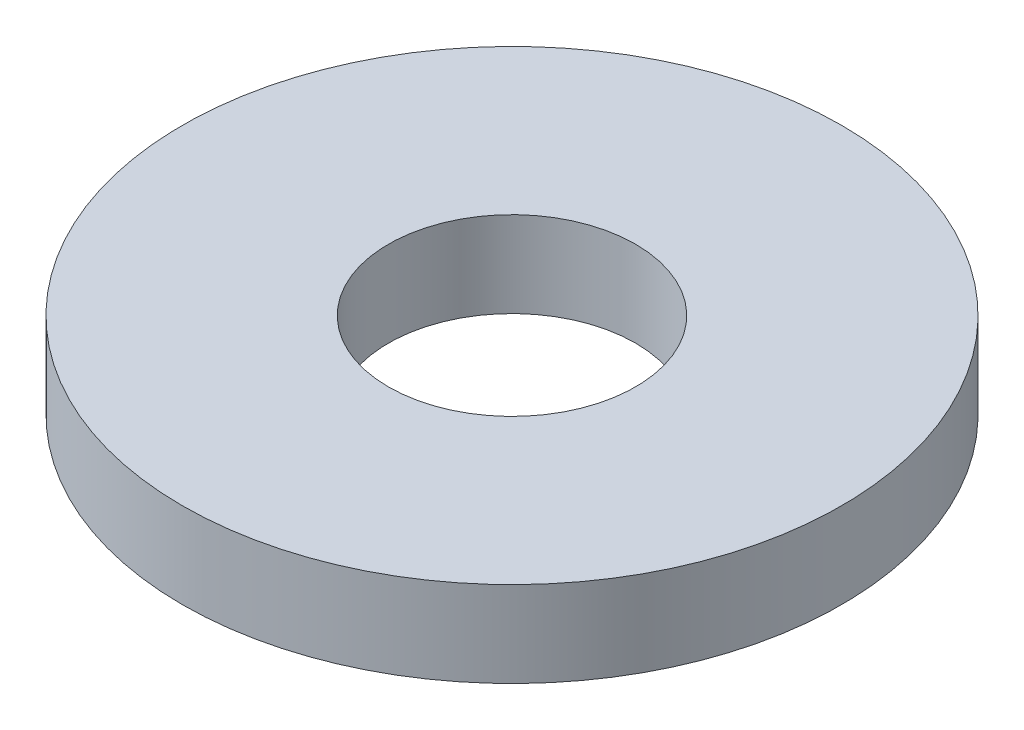
ISO-10303-21;
HEADER;
FILE_DESCRIPTION(('STEP AP214'),'2;1');
FILE_NAME('part.step','',(''),(''),'','','');
FILE_SCHEMA(('AUTOMOTIVE_DESIGN { 1 0 10303 214 1 1 1 1 }'));
ENDSEC;
DATA;
#1=APPLICATION_CONTEXT('core data for automotive mechanical design processes');
#2=APPLICATION_PROTOCOL_DEFINITION('international standard','automotive_design',2000,#1);
#3=PRODUCT_CONTEXT('',#1,'mechanical');
#4=PRODUCT('Part','Part','',(#3));
#5=PRODUCT_RELATED_PRODUCT_CATEGORY('part','',(#4));
#6=PRODUCT_DEFINITION_FORMATION('','',#4);
#7=PRODUCT_DEFINITION_CONTEXT('part definition',#1,'design');
#8=PRODUCT_DEFINITION('design','',#6,#7);
#9=PRODUCT_DEFINITION_SHAPE('','',#8);
#10=(LENGTH_UNIT() NAMED_UNIT(*) SI_UNIT(.MILLI.,.METRE.));
#11=(NAMED_UNIT(*) PLANE_ANGLE_UNIT() SI_UNIT($,.RADIAN.));
#12=(NAMED_UNIT(*) SI_UNIT($,.STERADIAN.) SOLID_ANGLE_UNIT());
#13=UNCERTAINTY_MEASURE_WITH_UNIT(LENGTH_MEASURE(1.E-05),#10,'distance_accuracy_value','');
#14=(GEOMETRIC_REPRESENTATION_CONTEXT(3) GLOBAL_UNCERTAINTY_ASSIGNED_CONTEXT((#13)) GLOBAL_UNIT_ASSIGNED_CONTEXT((#10,
#11,#12)) REPRESENTATION_CONTEXT('',''));
#15=CARTESIAN_POINT('',(0.,0.,0.));
#16=DIRECTION('',(0.,0.,1.));
#17=DIRECTION('',(1.,0.,0.));
#18=AXIS2_PLACEMENT_3D('',#15,#16,#17);
#19=CARTESIAN_POINT('',(0.,26.,0.));
#20=DIRECTION('',(0.,-1.,0.));
#21=DIRECTION('',(0.,0.,-1.));
#22=AXIS2_PLACEMENT_3D('',#19,#20,#21);
#23=CYLINDRICAL_SURFACE('',#22,100.);
#24=CARTESIAN_POINT('',(0.,26.,0.));
#25=DIRECTION('',(0.,1.,0.));
#26=DIRECTION('',(0.,0.,1.));
#27=AXIS2_PLACEMENT_3D('',#24,#25,#26);
#28=CIRCLE('',#27,100.);
#29=CARTESIAN_POINT('',(0.,26.,-100.));
#30=VERTEX_POINT('',#29);
#31=EDGE_CURVE('E10',#30,#30,#28,.T.);
#32=CARTESIAN_POINT('',(0.,0.,0.));
#33=DIRECTION('',(0.,1.,0.));
#34=DIRECTION('',(0.,0.,1.));
#35=AXIS2_PLACEMENT_3D('',#32,#33,#34);
#36=CIRCLE('',#35,100.);
#37=CARTESIAN_POINT('',(0.,0.,-100.));
#38=VERTEX_POINT('',#37);
#39=EDGE_CURVE('E37',#38,#38,#36,.T.);
#40=CARTESIAN_POINT('',(0.,26.,-100.));
#41=CARTESIAN_POINT('',(0.,25.7291666666667,-100.));
#42=CARTESIAN_POINT('',(0.,25.4583333333333,-100.));
#43=CARTESIAN_POINT('',(0.,24.9166666666667,-100.));
#44=CARTESIAN_POINT('',(0.,24.6458333333333,-100.));
#45=CARTESIAN_POINT('',(0.,24.1041666666667,-100.));
#46=CARTESIAN_POINT('',(0.,23.8333333333333,-100.));
#47=CARTESIAN_POINT('',(0.,23.2916666666667,-100.));
#48=CARTESIAN_POINT('',(0.,23.0208333333333,-100.));
#49=CARTESIAN_POINT('',(0.,22.4791666666667,-100.));
#50=CARTESIAN_POINT('',(0.,22.2083333333333,-100.));
#51=CARTESIAN_POINT('',(0.,21.6666666666667,-100.));
#52=CARTESIAN_POINT('',(0.,21.3958333333333,-100.));
#53=CARTESIAN_POINT('',(0.,20.8541666666667,-100.));
#54=CARTESIAN_POINT('',(0.,20.5833333333333,-100.));
#55=CARTESIAN_POINT('',(0.,20.0416666666667,-100.));
#56=CARTESIAN_POINT('',(0.,19.7708333333333,-100.));
#57=CARTESIAN_POINT('',(0.,19.2291666666667,-100.));
#58=CARTESIAN_POINT('',(0.,18.9583333333333,-100.));
#59=CARTESIAN_POINT('',(0.,18.4166666666667,-100.));
#60=CARTESIAN_POINT('',(0.,18.1458333333333,-100.));
#61=CARTESIAN_POINT('',(0.,17.6041666666667,-100.));
#62=CARTESIAN_POINT('',(0.,17.3333333333333,-100.));
#63=CARTESIAN_POINT('',(0.,16.7916666666667,-100.));
#64=CARTESIAN_POINT('',(0.,16.5208333333333,-100.));
#65=CARTESIAN_POINT('',(0.,15.9791666666667,-100.));
#66=CARTESIAN_POINT('',(0.,15.7083333333333,-100.));
#67=CARTESIAN_POINT('',(0.,15.1666666666667,-100.));
#68=CARTESIAN_POINT('',(0.,14.8958333333333,-100.));
#69=CARTESIAN_POINT('',(0.,14.3541666666667,-100.));
#70=CARTESIAN_POINT('',(0.,14.0833333333333,-100.));
#71=CARTESIAN_POINT('',(0.,13.5416666666667,-100.));
#72=CARTESIAN_POINT('',(0.,13.2708333333333,-100.));
#73=CARTESIAN_POINT('',(0.,12.7291666666667,-100.));
#74=CARTESIAN_POINT('',(0.,12.4583333333333,-100.));
#75=CARTESIAN_POINT('',(0.,11.9166666666667,-100.));
#76=CARTESIAN_POINT('',(0.,11.6458333333333,-100.));
#77=CARTESIAN_POINT('',(0.,11.1041666666667,-100.));
#78=CARTESIAN_POINT('',(0.,10.8333333333333,-100.));
#79=CARTESIAN_POINT('',(0.,10.2916666666667,-100.));
#80=CARTESIAN_POINT('',(0.,10.0208333333333,-100.));
#81=CARTESIAN_POINT('',(0.,9.47916666666667,-100.));
#82=CARTESIAN_POINT('',(0.,9.20833333333333,-100.));
#83=CARTESIAN_POINT('',(0.,8.66666666666667,-100.));
#84=CARTESIAN_POINT('',(0.,8.39583333333333,-100.));
#85=CARTESIAN_POINT('',(0.,7.85416666666667,-100.));
#86=CARTESIAN_POINT('',(0.,7.58333333333333,-100.));
#87=CARTESIAN_POINT('',(0.,7.04166666666667,-100.));
#88=CARTESIAN_POINT('',(0.,6.77083333333333,-100.));
#89=CARTESIAN_POINT('',(0.,6.22916666666667,-100.));
#90=CARTESIAN_POINT('',(0.,5.95833333333333,-100.));
#91=CARTESIAN_POINT('',(0.,5.41666666666667,-100.));
#92=CARTESIAN_POINT('',(0.,5.14583333333333,-100.));
#93=CARTESIAN_POINT('',(0.,4.60416666666667,-100.));
#94=CARTESIAN_POINT('',(0.,4.33333333333333,-100.));
#95=CARTESIAN_POINT('',(0.,3.79166666666667,-100.));
#96=CARTESIAN_POINT('',(0.,3.52083333333333,-100.));
#97=CARTESIAN_POINT('',(0.,2.97916666666667,-100.));
#98=CARTESIAN_POINT('',(0.,2.70833333333333,-100.));
#99=CARTESIAN_POINT('',(0.,2.16666666666667,-100.));
#100=CARTESIAN_POINT('',(0.,1.89583333333333,-100.));
#101=CARTESIAN_POINT('',(0.,1.35416666666667,-100.));
#102=CARTESIAN_POINT('',(0.,1.08333333333333,-100.));
#103=CARTESIAN_POINT('',(0.,0.541666666666667,-100.));
#104=CARTESIAN_POINT('',(0.,0.270833333333334,-100.));
#105=CARTESIAN_POINT('',(0.,0.,-100.));
#106=B_SPLINE_CURVE_WITH_KNOTS('',3,(#40,#41,#42,#43,#44,#45,#46,#47,#48,#49,#50,#51,#52,#53,
#54,#55,#56,#57,#58,#59,#60,#61,#62,#63,#64,#65,#66,#67,#68,#69,#70,#71,#72,#73,#74,#75,#76,#77,
#78,#79,#80,#81,#82,#83,#84,#85,#86,#87,#88,#89,#90,#91,#92,#93,#94,#95,#96,#97,#98,#99,#100,
#101,#102,#103,#104,#105),.UNSPECIFIED.,.F.,.F.,(4,2,2,2,2,2,2,2,2,2,2,2,2,2,2,2,2,2,2,2,2,2,2,
2,2,2,2,2,2,2,2,2,4),(0.,0.812500000000001,1.625,2.4375,3.25,4.0625,4.875,5.6875,6.5,7.3125,
8.125,8.9375,9.75,10.5625,11.375,12.1875,13.,13.8125,14.625,15.4375,16.25,17.0625,17.875,
18.6875,19.5,20.3125,21.125,21.9375,22.75,23.5625,24.375,25.1875,26.),.UNSPECIFIED.);
#107=EDGE_CURVE('BSEAM40',#30,#38,#106,.T.);
#108=ORIENTED_EDGE('',*,*,#31,.F.);
#109=ORIENTED_EDGE('',*,*,#39,.T.);
#110=ORIENTED_EDGE('',*,*,#107,.T.);
#111=ORIENTED_EDGE('',*,*,#107,.F.);
#112=EDGE_LOOP('',(#108,#110,#109,#111));
#113=FACE_BOUND('',#112,.T.);
#114=ADVANCED_FACE('F40',(#113),#23,.T.);
#115=CARTESIAN_POINT('',(0.,26.,0.));
#116=DIRECTION('',(0.,1.,0.));
#117=DIRECTION('',(0.,0.,1.));
#118=AXIS2_PLACEMENT_3D('',#115,#116,#117);
#119=PLANE('',#118);
#120=CARTESIAN_POINT('',(0.,26.,0.));
#121=DIRECTION('',(0.,1.,0.));
#122=DIRECTION('',(0.,0.,1.));
#123=AXIS2_PLACEMENT_3D('',#120,#121,#122);
#124=CIRCLE('',#123,37.5);
#125=CARTESIAN_POINT('',(0.,26.,-37.5));
#126=VERTEX_POINT('',#125);
#127=EDGE_CURVE('E50',#126,#126,#124,.T.);
#128=ORIENTED_EDGE('',*,*,#127,.F.);
#129=EDGE_LOOP('',(#128));
#130=FACE_BOUND('',#129,.T.);
#131=ORIENTED_EDGE('',*,*,#31,.T.);
#132=EDGE_LOOP('',(#131));
#133=FACE_BOUND('',#132,.T.);
#134=ADVANCED_FACE('F59',(#130,#133),#119,.T.);
#135=CARTESIAN_POINT('',(0.,0.,0.));
#136=DIRECTION('',(0.,1.,0.));
#137=DIRECTION('',(0.,0.,1.));
#138=AXIS2_PLACEMENT_3D('',#135,#136,#137);
#139=PLANE('',#138);
#140=CARTESIAN_POINT('',(0.,0.,0.));
#141=DIRECTION('',(0.,1.,0.));
#142=DIRECTION('',(0.,0.,1.));
#143=AXIS2_PLACEMENT_3D('',#140,#141,#142);
#144=CIRCLE('',#143,37.5);
#145=CARTESIAN_POINT('',(0.,0.,-37.5));
#146=VERTEX_POINT('',#145);
#147=EDGE_CURVE('E47',#146,#146,#144,.T.);
#148=ORIENTED_EDGE('',*,*,#147,.T.);
#149=EDGE_LOOP('',(#148));
#150=FACE_BOUND('',#149,.T.);
#151=ORIENTED_EDGE('',*,*,#39,.F.);
#152=EDGE_LOOP('',(#151));
#153=FACE_BOUND('',#152,.T.);
#154=ADVANCED_FACE('F58',(#150,#153),#139,.F.);
#155=CARTESIAN_POINT('',(0.,26.,0.));
#156=DIRECTION('',(0.,-1.,0.));
#157=DIRECTION('',(0.,0.,-1.));
#158=AXIS2_PLACEMENT_3D('',#155,#156,#157);
#159=CYLINDRICAL_SURFACE('',#158,37.5);
#160=CARTESIAN_POINT('',(0.,26.,-37.5));
#161=CARTESIAN_POINT('',(0.,25.7291666666667,-37.5));
#162=CARTESIAN_POINT('',(0.,25.4583333333333,-37.5));
#163=CARTESIAN_POINT('',(0.,24.9166666666667,-37.5));
#164=CARTESIAN_POINT('',(0.,24.6458333333333,-37.5));
#165=CARTESIAN_POINT('',(0.,24.1041666666667,-37.5));
#166=CARTESIAN_POINT('',(0.,23.8333333333333,-37.5));
#167=CARTESIAN_POINT('',(0.,23.2916666666667,-37.5));
#168=CARTESIAN_POINT('',(0.,23.0208333333333,-37.5));
#169=CARTESIAN_POINT('',(0.,22.4791666666667,-37.5));
#170=CARTESIAN_POINT('',(0.,22.2083333333333,-37.5));
#171=CARTESIAN_POINT('',(0.,21.6666666666667,-37.5));
#172=CARTESIAN_POINT('',(0.,21.3958333333333,-37.5));
#173=CARTESIAN_POINT('',(0.,20.8541666666667,-37.5));
#174=CARTESIAN_POINT('',(0.,20.5833333333333,-37.5));
#175=CARTESIAN_POINT('',(0.,20.0416666666667,-37.5));
#176=CARTESIAN_POINT('',(0.,19.7708333333333,-37.5));
#177=CARTESIAN_POINT('',(0.,19.2291666666667,-37.5));
#178=CARTESIAN_POINT('',(0.,18.9583333333333,-37.5));
#179=CARTESIAN_POINT('',(0.,18.4166666666667,-37.5));
#180=CARTESIAN_POINT('',(0.,18.1458333333333,-37.5));
#181=CARTESIAN_POINT('',(0.,17.6041666666667,-37.5));
#182=CARTESIAN_POINT('',(0.,17.3333333333333,-37.5));
#183=CARTESIAN_POINT('',(0.,16.7916666666667,-37.5));
#184=CARTESIAN_POINT('',(0.,16.5208333333333,-37.5));
#185=CARTESIAN_POINT('',(0.,15.9791666666667,-37.5));
#186=CARTESIAN_POINT('',(0.,15.7083333333333,-37.5));
#187=CARTESIAN_POINT('',(0.,15.1666666666667,-37.5));
#188=CARTESIAN_POINT('',(0.,14.8958333333333,-37.5));
#189=CARTESIAN_POINT('',(0.,14.3541666666667,-37.5));
#190=CARTESIAN_POINT('',(0.,14.0833333333333,-37.5));
#191=CARTESIAN_POINT('',(0.,13.5416666666667,-37.5));
#192=CARTESIAN_POINT('',(0.,13.2708333333333,-37.5));
#193=CARTESIAN_POINT('',(0.,12.7291666666667,-37.5));
#194=CARTESIAN_POINT('',(0.,12.4583333333333,-37.5));
#195=CARTESIAN_POINT('',(0.,11.9166666666667,-37.5));
#196=CARTESIAN_POINT('',(0.,11.6458333333333,-37.5));
#197=CARTESIAN_POINT('',(0.,11.1041666666667,-37.5));
#198=CARTESIAN_POINT('',(0.,10.8333333333333,-37.5));
#199=CARTESIAN_POINT('',(0.,10.2916666666667,-37.5));
#200=CARTESIAN_POINT('',(0.,10.0208333333333,-37.5));
#201=CARTESIAN_POINT('',(0.,9.47916666666667,-37.5));
#202=CARTESIAN_POINT('',(0.,9.20833333333333,-37.5));
#203=CARTESIAN_POINT('',(0.,8.66666666666667,-37.5));
#204=CARTESIAN_POINT('',(0.,8.39583333333333,-37.5));
#205=CARTESIAN_POINT('',(0.,7.85416666666667,-37.5));
#206=CARTESIAN_POINT('',(0.,7.58333333333333,-37.5));
#207=CARTESIAN_POINT('',(0.,7.04166666666667,-37.5));
#208=CARTESIAN_POINT('',(0.,6.77083333333333,-37.5));
#209=CARTESIAN_POINT('',(0.,6.22916666666667,-37.5));
#210=CARTESIAN_POINT('',(0.,5.95833333333333,-37.5));
#211=CARTESIAN_POINT('',(0.,5.41666666666667,-37.5));
#212=CARTESIAN_POINT('',(0.,5.14583333333333,-37.5));
#213=CARTESIAN_POINT('',(0.,4.60416666666667,-37.5));
#214=CARTESIAN_POINT('',(0.,4.33333333333333,-37.5));
#215=CARTESIAN_POINT('',(0.,3.79166666666667,-37.5));
#216=CARTESIAN_POINT('',(0.,3.52083333333333,-37.5));
#217=CARTESIAN_POINT('',(0.,2.97916666666667,-37.5));
#218=CARTESIAN_POINT('',(0.,2.70833333333333,-37.5));
#219=CARTESIAN_POINT('',(0.,2.16666666666667,-37.5));
#220=CARTESIAN_POINT('',(0.,1.89583333333333,-37.5));
#221=CARTESIAN_POINT('',(0.,1.35416666666667,-37.5));
#222=CARTESIAN_POINT('',(0.,1.08333333333333,-37.5));
#223=CARTESIAN_POINT('',(0.,0.541666666666667,-37.5));
#224=CARTESIAN_POINT('',(0.,0.270833333333334,-37.5));
#225=CARTESIAN_POINT('',(0.,0.,-37.5));
#226=B_SPLINE_CURVE_WITH_KNOTS('',3,(#160,#161,#162,#163,#164,#165,#166,#167,#168,#169,#170,
#171,#172,#173,#174,#175,#176,#177,#178,#179,#180,#181,#182,#183,#184,#185,#186,#187,#188,#189,
#190,#191,#192,#193,#194,#195,#196,#197,#198,#199,#200,#201,#202,#203,#204,#205,#206,#207,#208,
#209,#210,#211,#212,#213,#214,#215,#216,#217,#218,#219,#220,#221,#222,#223,#224,#225),
.UNSPECIFIED.,.F.,.F.,(4,2,2,2,2,2,2,2,2,2,2,2,2,2,2,2,2,2,2,2,2,2,2,2,2,2,2,2,2,2,2,2,4),(0.,
0.812499999999997,1.625,2.4375,3.25,4.0625,4.875,5.6875,6.5,7.3125,8.125,8.93749999999999,
9.74999999999999,10.5625,11.375,12.1875,13.,13.8125,14.625,15.4375,16.25,17.0625,17.875,18.6875,
19.5,20.3125,21.125,21.9375,22.75,23.5625,24.375,25.1875,26.),.UNSPECIFIED.);
#227=EDGE_CURVE('BSEAM54',#126,#146,#226,.T.);
#228=ORIENTED_EDGE('',*,*,#127,.T.);
#229=ORIENTED_EDGE('',*,*,#147,.F.);
#230=ORIENTED_EDGE('',*,*,#227,.T.);
#231=ORIENTED_EDGE('',*,*,#227,.F.);
#232=EDGE_LOOP('',(#228,#230,#229,#231));
#233=FACE_BOUND('',#232,.T.);
#234=ADVANCED_FACE('F54',(#233),#159,.F.);
#235=CLOSED_SHELL('',(#114,#134,#154,#234));
#236=MANIFOLD_SOLID_BREP('B2',#235);
#237=ADVANCED_BREP_SHAPE_REPRESENTATION('',(#18,#236),#14);
#238=SHAPE_DEFINITION_REPRESENTATION(#9,#237);
ENDSEC;
END-ISO-10303-21;
